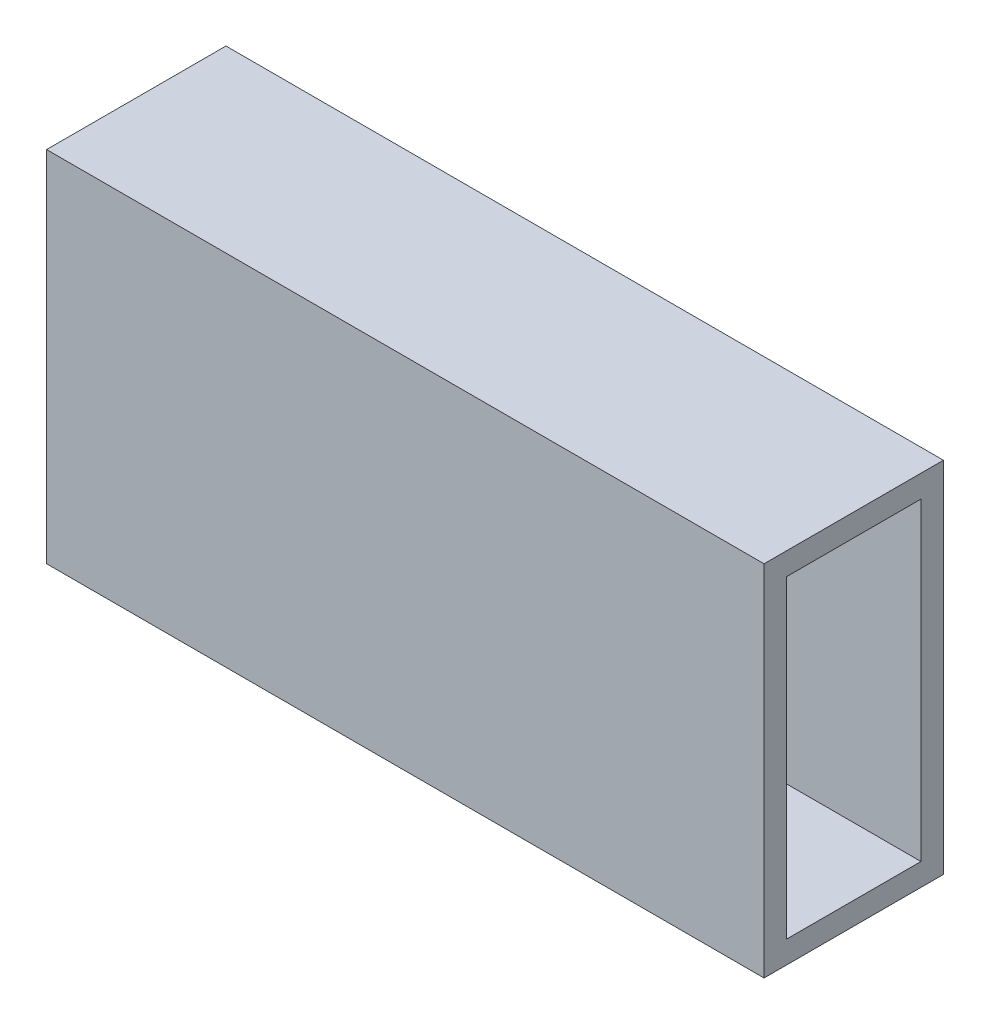
ISO-10303-21;
HEADER;
FILE_DESCRIPTION(('STEP AP214'),'2;1');
FILE_NAME('part.step','',(''),(''),'','','');
FILE_SCHEMA(('AUTOMOTIVE_DESIGN { 1 0 10303 214 1 1 1 1 }'));
ENDSEC;
DATA;
#1=APPLICATION_CONTEXT('core data for automotive mechanical design processes');
#2=APPLICATION_PROTOCOL_DEFINITION('international standard','automotive_design',2000,#1);
#3=PRODUCT_CONTEXT('',#1,'mechanical');
#4=PRODUCT('Part','Part','',(#3));
#5=PRODUCT_RELATED_PRODUCT_CATEGORY('part','',(#4));
#6=PRODUCT_DEFINITION_FORMATION('','',#4);
#7=PRODUCT_DEFINITION_CONTEXT('part definition',#1,'design');
#8=PRODUCT_DEFINITION('design','',#6,#7);
#9=PRODUCT_DEFINITION_SHAPE('','',#8);
#10=(LENGTH_UNIT() NAMED_UNIT(*) SI_UNIT(.MILLI.,.METRE.));
#11=(NAMED_UNIT(*) PLANE_ANGLE_UNIT() SI_UNIT($,.RADIAN.));
#12=(NAMED_UNIT(*) SI_UNIT($,.STERADIAN.) SOLID_ANGLE_UNIT());
#13=UNCERTAINTY_MEASURE_WITH_UNIT(LENGTH_MEASURE(1.E-05),#10,'distance_accuracy_value','');
#14=(GEOMETRIC_REPRESENTATION_CONTEXT(3) GLOBAL_UNCERTAINTY_ASSIGNED_CONTEXT((#13)) GLOBAL_UNIT_ASSIGNED_CONTEXT((#10,
#11,#12)) REPRESENTATION_CONTEXT('',''));
#15=CARTESIAN_POINT('',(0.,0.,0.));
#16=DIRECTION('',(0.,0.,1.));
#17=DIRECTION('',(1.,0.,0.));
#18=AXIS2_PLACEMENT_3D('',#15,#16,#17);
#19=CARTESIAN_POINT('',(254.,0.,0.));
#20=DIRECTION('',(0.,0.,-1.));
#21=DIRECTION('',(-1.,0.,0.));
#22=AXIS2_PLACEMENT_3D('',#19,#20,#21);
#23=PLANE('',#22);
#24=DIRECTION('',(0.,1.,0.));
#25=VECTOR('',#24,1.);
#26=CARTESIAN_POINT('',(152.4,0.,0.));
#27=LINE('',#26,#25);
#28=CARTESIAN_POINT('',(152.4,0.,0.));
#29=VERTEX_POINT('',#28);
#30=CARTESIAN_POINT('',(152.4,50.8,0.));
#31=VERTEX_POINT('',#30);
#32=EDGE_CURVE('E47',#29,#31,#27,.T.);
#33=ORIENTED_EDGE('',*,*,#32,.F.);
#34=DIRECTION('',(-1.,0.,0.));
#35=VECTOR('',#34,1.);
#36=CARTESIAN_POINT('',(254.,0.,0.));
#37=LINE('',#36,#35);
#38=CARTESIAN_POINT('',(254.,0.,0.));
#39=VERTEX_POINT('',#38);
#40=EDGE_CURVE('E40',#39,#29,#37,.T.);
#41=ORIENTED_EDGE('',*,*,#40,.F.);
#42=DIRECTION('',(0.,-1.,0.));
#43=VECTOR('',#42,1.);
#44=CARTESIAN_POINT('',(254.,0.,0.));
#45=LINE('',#44,#43);
#46=CARTESIAN_POINT('',(254.,50.8,0.));
#47=VERTEX_POINT('',#46);
#48=EDGE_CURVE('E126',#47,#39,#45,.T.);
#49=ORIENTED_EDGE('',*,*,#48,.F.);
#50=DIRECTION('',(-1.,0.,0.));
#51=VECTOR('',#50,1.);
#52=CARTESIAN_POINT('',(254.,50.8,0.));
#53=LINE('',#52,#51);
#54=EDGE_CURVE('E116',#47,#31,#53,.T.);
#55=ORIENTED_EDGE('',*,*,#54,.T.);
#56=EDGE_LOOP('',(#33,#41,#49,#55));
#57=FACE_BOUND('',#56,.T.);
#58=ADVANCED_FACE('F33',(#57),#23,.F.);
#59=CARTESIAN_POINT('',(254.,0.,0.));
#60=DIRECTION('',(0.,1.,0.));
#61=DIRECTION('',(0.,0.,1.));
#62=AXIS2_PLACEMENT_3D('',#59,#60,#61);
#63=PLANE('',#62);
#64=DIRECTION('',(0.,0.,-1.));
#65=VECTOR('',#64,1.);
#66=CARTESIAN_POINT('',(152.4,0.,123.698));
#67=LINE('',#66,#65);
#68=CARTESIAN_POINT('',(152.4,0.,-25.4));
#69=VERTEX_POINT('',#68);
#70=EDGE_CURVE('E97',#29,#69,#67,.T.);
#71=ORIENTED_EDGE('',*,*,#70,.T.);
#72=DIRECTION('',(-1.,0.,0.));
#73=VECTOR('',#72,1.);
#74=CARTESIAN_POINT('',(254.,0.,-25.4));
#75=LINE('',#74,#73);
#76=CARTESIAN_POINT('',(254.,0.,-25.4));
#77=VERTEX_POINT('',#76);
#78=EDGE_CURVE('E108',#77,#69,#75,.T.);
#79=ORIENTED_EDGE('',*,*,#78,.F.);
#80=DIRECTION('',(0.,0.,-1.));
#81=VECTOR('',#80,1.);
#82=CARTESIAN_POINT('',(254.,0.,0.));
#83=LINE('',#82,#81);
#84=EDGE_CURVE('E124',#39,#77,#83,.T.);
#85=ORIENTED_EDGE('',*,*,#84,.F.);
#86=ORIENTED_EDGE('',*,*,#40,.T.);
#87=EDGE_LOOP('',(#71,#79,#85,#86));
#88=FACE_BOUND('',#87,.T.);
#89=ADVANCED_FACE('F107',(#88),#63,.F.);
#90=CARTESIAN_POINT('',(254.,0.,-25.4));
#91=DIRECTION('',(0.,0.,1.));
#92=DIRECTION('',(1.,0.,0.));
#93=AXIS2_PLACEMENT_3D('',#90,#91,#92);
#94=PLANE('',#93);
#95=DIRECTION('',(0.,1.,0.));
#96=VECTOR('',#95,1.);
#97=CARTESIAN_POINT('',(152.4,0.,-25.4));
#98=LINE('',#97,#96);
#99=CARTESIAN_POINT('',(152.4,50.8,-25.4));
#100=VERTEX_POINT('',#99);
#101=EDGE_CURVE('E94',#69,#100,#98,.T.);
#102=ORIENTED_EDGE('',*,*,#101,.T.);
#103=DIRECTION('',(-1.,0.,0.));
#104=VECTOR('',#103,1.);
#105=CARTESIAN_POINT('',(254.,50.8,-25.4));
#106=LINE('',#105,#104);
#107=CARTESIAN_POINT('',(254.,50.8,-25.4));
#108=VERTEX_POINT('',#107);
#109=EDGE_CURVE('E114',#108,#100,#106,.T.);
#110=ORIENTED_EDGE('',*,*,#109,.F.);
#111=DIRECTION('',(0.,1.,0.));
#112=VECTOR('',#111,1.);
#113=CARTESIAN_POINT('',(254.,0.,-25.4));
#114=LINE('',#113,#112);
#115=EDGE_CURVE('E113',#77,#108,#114,.T.);
#116=ORIENTED_EDGE('',*,*,#115,.F.);
#117=ORIENTED_EDGE('',*,*,#78,.T.);
#118=EDGE_LOOP('',(#102,#110,#116,#117));
#119=FACE_BOUND('',#118,.T.);
#120=ADVANCED_FACE('F112',(#119),#94,.F.);
#121=CARTESIAN_POINT('',(254.,50.8,0.));
#122=DIRECTION('',(0.,-1.,0.));
#123=DIRECTION('',(0.,0.,-1.));
#124=AXIS2_PLACEMENT_3D('',#121,#122,#123);
#125=PLANE('',#124);
#126=DIRECTION('',(0.,0.,-1.));
#127=VECTOR('',#126,1.);
#128=CARTESIAN_POINT('',(152.4,50.8,123.698));
#129=LINE('',#128,#127);
#130=EDGE_CURVE('E98',#31,#100,#129,.T.);
#131=ORIENTED_EDGE('',*,*,#130,.F.);
#132=ORIENTED_EDGE('',*,*,#54,.F.);
#133=DIRECTION('',(0.,0.,1.));
#134=VECTOR('',#133,1.);
#135=CARTESIAN_POINT('',(254.,50.8,0.));
#136=LINE('',#135,#134);
#137=EDGE_CURVE('E121',#108,#47,#136,.T.);
#138=ORIENTED_EDGE('',*,*,#137,.F.);
#139=ORIENTED_EDGE('',*,*,#109,.T.);
#140=EDGE_LOOP('',(#131,#132,#138,#139));
#141=FACE_BOUND('',#140,.T.);
#142=ADVANCED_FACE('F194',(#141),#125,.F.);
#143=CARTESIAN_POINT('',(254.,47.625,-3.175));
#144=DIRECTION('',(0.,0.,-1.));
#145=DIRECTION('',(0.,1.,0.));
#146=AXIS2_PLACEMENT_3D('',#143,#144,#145);
#147=PLANE('',#146);
#148=DIRECTION('',(-1.,0.,0.));
#149=VECTOR('',#148,1.);
#150=CARTESIAN_POINT('',(254.,3.175,-3.175));
#151=LINE('',#150,#149);
#152=CARTESIAN_POINT('',(254.,3.175,-3.175));
#153=VERTEX_POINT('',#152);
#154=CARTESIAN_POINT('',(152.4,3.175,-3.175));
#155=VERTEX_POINT('',#154);
#156=EDGE_CURVE('E129',#153,#155,#151,.T.);
#157=ORIENTED_EDGE('',*,*,#156,.T.);
#158=DIRECTION('',(0.,1.,0.));
#159=VECTOR('',#158,1.);
#160=CARTESIAN_POINT('',(152.4,47.625,-3.175));
#161=LINE('',#160,#159);
#162=CARTESIAN_POINT('',(152.4,47.625,-3.175));
#163=VERTEX_POINT('',#162);
#164=EDGE_CURVE('E151',#155,#163,#161,.T.);
#165=ORIENTED_EDGE('',*,*,#164,.T.);
#166=DIRECTION('',(-1.,0.,0.));
#167=VECTOR('',#166,1.);
#168=CARTESIAN_POINT('',(254.,47.625,-3.175));
#169=LINE('',#168,#167);
#170=CARTESIAN_POINT('',(254.,47.625,-3.175));
#171=VERTEX_POINT('',#170);
#172=EDGE_CURVE('E138',#171,#163,#169,.T.);
#173=ORIENTED_EDGE('',*,*,#172,.F.);
#174=DIRECTION('',(0.,-1.,0.));
#175=VECTOR('',#174,1.);
#176=CARTESIAN_POINT('',(254.,47.625,-3.175));
#177=LINE('',#176,#175);
#178=EDGE_CURVE('E148',#171,#153,#177,.T.);
#179=ORIENTED_EDGE('',*,*,#178,.T.);
#180=EDGE_LOOP('',(#157,#165,#173,#179));
#181=FACE_BOUND('',#180,.T.);
#182=ADVANCED_FACE('F174',(#181),#147,.T.);
#183=CARTESIAN_POINT('',(254.,3.175,-3.175));
#184=DIRECTION('',(0.,1.,0.));
#185=DIRECTION('',(0.,0.,1.));
#186=AXIS2_PLACEMENT_3D('',#183,#184,#185);
#187=PLANE('',#186);
#188=DIRECTION('',(-1.,0.,0.));
#189=VECTOR('',#188,1.);
#190=CARTESIAN_POINT('',(254.,3.175,-22.225));
#191=LINE('',#190,#189);
#192=CARTESIAN_POINT('',(254.,3.175,-22.225));
#193=VERTEX_POINT('',#192);
#194=CARTESIAN_POINT('',(152.4,3.175,-22.225));
#195=VERTEX_POINT('',#194);
#196=EDGE_CURVE('E132',#193,#195,#191,.T.);
#197=ORIENTED_EDGE('',*,*,#196,.T.);
#198=DIRECTION('',(0.,0.,1.));
#199=VECTOR('',#198,1.);
#200=CARTESIAN_POINT('',(152.4,3.175,-3.175));
#201=LINE('',#200,#199);
#202=EDGE_CURVE('E154',#195,#155,#201,.T.);
#203=ORIENTED_EDGE('',*,*,#202,.T.);
#204=ORIENTED_EDGE('',*,*,#156,.F.);
#205=DIRECTION('',(0.,0.,-1.));
#206=VECTOR('',#205,1.);
#207=CARTESIAN_POINT('',(254.,3.175,-3.175));
#208=LINE('',#207,#206);
#209=EDGE_CURVE('E146',#153,#193,#208,.T.);
#210=ORIENTED_EDGE('',*,*,#209,.T.);
#211=EDGE_LOOP('',(#197,#203,#204,#210));
#212=FACE_BOUND('',#211,.T.);
#213=ADVANCED_FACE('F163',(#212),#187,.T.);
#214=CARTESIAN_POINT('',(254.,47.625,-22.225));
#215=DIRECTION('',(0.,0.,1.));
#216=DIRECTION('',(0.,-1.,0.));
#217=AXIS2_PLACEMENT_3D('',#214,#215,#216);
#218=PLANE('',#217);
#219=DIRECTION('',(-1.,0.,0.));
#220=VECTOR('',#219,1.);
#221=CARTESIAN_POINT('',(254.,47.625,-22.225));
#222=LINE('',#221,#220);
#223=CARTESIAN_POINT('',(254.,47.625,-22.225));
#224=VERTEX_POINT('',#223);
#225=CARTESIAN_POINT('',(152.4,47.625,-22.225));
#226=VERTEX_POINT('',#225);
#227=EDGE_CURVE('E135',#224,#226,#222,.T.);
#228=ORIENTED_EDGE('',*,*,#227,.T.);
#229=DIRECTION('',(0.,-1.,0.));
#230=VECTOR('',#229,1.);
#231=CARTESIAN_POINT('',(152.4,47.625,-22.225));
#232=LINE('',#231,#230);
#233=EDGE_CURVE('E55',#226,#195,#232,.T.);
#234=ORIENTED_EDGE('',*,*,#233,.T.);
#235=ORIENTED_EDGE('',*,*,#196,.F.);
#236=DIRECTION('',(0.,1.,0.));
#237=VECTOR('',#236,1.);
#238=CARTESIAN_POINT('',(254.,47.625,-22.225));
#239=LINE('',#238,#237);
#240=EDGE_CURVE('E143',#193,#224,#239,.T.);
#241=ORIENTED_EDGE('',*,*,#240,.T.);
#242=EDGE_LOOP('',(#228,#234,#235,#241));
#243=FACE_BOUND('',#242,.T.);
#244=ADVANCED_FACE('F160',(#243),#218,.T.);
#245=CARTESIAN_POINT('',(254.,47.625,-3.175));
#246=DIRECTION('',(0.,-1.,0.));
#247=DIRECTION('',(0.,0.,-1.));
#248=AXIS2_PLACEMENT_3D('',#245,#246,#247);
#249=PLANE('',#248);
#250=ORIENTED_EDGE('',*,*,#172,.T.);
#251=DIRECTION('',(0.,0.,-1.));
#252=VECTOR('',#251,1.);
#253=CARTESIAN_POINT('',(152.4,47.625,-3.175));
#254=LINE('',#253,#252);
#255=EDGE_CURVE('E11',#163,#226,#254,.T.);
#256=ORIENTED_EDGE('',*,*,#255,.T.);
#257=ORIENTED_EDGE('',*,*,#227,.F.);
#258=DIRECTION('',(0.,0.,1.));
#259=VECTOR('',#258,1.);
#260=CARTESIAN_POINT('',(254.,47.625,-3.175));
#261=LINE('',#260,#259);
#262=EDGE_CURVE('E141',#224,#171,#261,.T.);
#263=ORIENTED_EDGE('',*,*,#262,.T.);
#264=EDGE_LOOP('',(#250,#256,#257,#263));
#265=FACE_BOUND('',#264,.T.);
#266=ADVANCED_FACE('F172',(#265),#249,.T.);
#267=CARTESIAN_POINT('',(254.,0.,0.));
#268=DIRECTION('',(-1.,0.,0.));
#269=DIRECTION('',(0.,0.,1.));
#270=AXIS2_PLACEMENT_3D('',#267,#268,#269);
#271=PLANE('',#270);
#272=ORIENTED_EDGE('',*,*,#48,.T.);
#273=ORIENTED_EDGE('',*,*,#84,.T.);
#274=ORIENTED_EDGE('',*,*,#115,.T.);
#275=ORIENTED_EDGE('',*,*,#137,.T.);
#276=EDGE_LOOP('',(#272,#273,#274,#275));
#277=FACE_BOUND('',#276,.T.);
#278=ORIENTED_EDGE('',*,*,#178,.F.);
#279=ORIENTED_EDGE('',*,*,#262,.F.);
#280=ORIENTED_EDGE('',*,*,#240,.F.);
#281=ORIENTED_EDGE('',*,*,#209,.F.);
#282=EDGE_LOOP('',(#278,#279,#280,#281));
#283=FACE_BOUND('',#282,.T.);
#284=ADVANCED_FACE('F168',(#277,#283),#271,.F.);
#285=CARTESIAN_POINT('',(152.4,0.,123.698));
#286=DIRECTION('',(-1.,0.,0.));
#287=DIRECTION('',(0.,0.,1.));
#288=AXIS2_PLACEMENT_3D('',#285,#286,#287);
#289=PLANE('',#288);
#290=ORIENTED_EDGE('',*,*,#202,.F.);
#291=ORIENTED_EDGE('',*,*,#233,.F.);
#292=ORIENTED_EDGE('',*,*,#255,.F.);
#293=ORIENTED_EDGE('',*,*,#164,.F.);
#294=EDGE_LOOP('',(#290,#291,#292,#293));
#295=FACE_BOUND('',#294,.T.);
#296=ORIENTED_EDGE('',*,*,#32,.T.);
#297=ORIENTED_EDGE('',*,*,#130,.T.);
#298=ORIENTED_EDGE('',*,*,#101,.F.);
#299=ORIENTED_EDGE('',*,*,#70,.F.);
#300=EDGE_LOOP('',(#296,#297,#298,#299));
#301=FACE_BOUND('',#300,.T.);
#302=ADVANCED_FACE('F96',(#295,#301),#289,.T.);
#303=CLOSED_SHELL('',(#58,#89,#120,#142,#182,#213,#244,#266,#284,#302));
#304=MANIFOLD_SOLID_BREP('B2',#303);
#305=ADVANCED_BREP_SHAPE_REPRESENTATION('',(#18,#304),#14);
#306=SHAPE_DEFINITION_REPRESENTATION(#9,#305);
ENDSEC;
END-ISO-10303-21;
